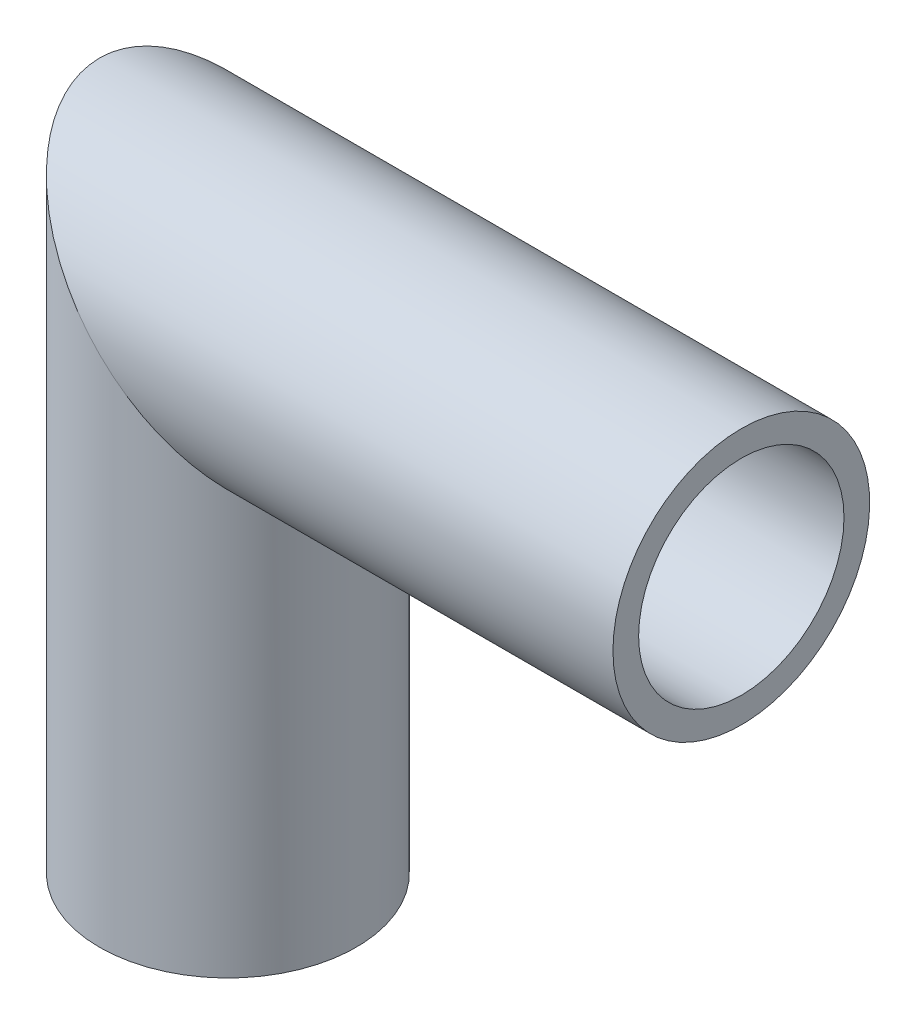
ISO-10303-21;
HEADER;
FILE_DESCRIPTION(('STEP AP214'),'2;1');
FILE_NAME('part.step','',(''),(''),'','','');
FILE_SCHEMA(('AUTOMOTIVE_DESIGN { 1 0 10303 214 1 1 1 1 }'));
ENDSEC;
DATA;
#1=APPLICATION_CONTEXT('core data for automotive mechanical design processes');
#2=APPLICATION_PROTOCOL_DEFINITION('international standard','automotive_design',2000,#1);
#3=PRODUCT_CONTEXT('',#1,'mechanical');
#4=PRODUCT('Part','Part','',(#3));
#5=PRODUCT_RELATED_PRODUCT_CATEGORY('part','',(#4));
#6=PRODUCT_DEFINITION_FORMATION('','',#4);
#7=PRODUCT_DEFINITION_CONTEXT('part definition',#1,'design');
#8=PRODUCT_DEFINITION('design','',#6,#7);
#9=PRODUCT_DEFINITION_SHAPE('','',#8);
#10=(LENGTH_UNIT() NAMED_UNIT(*) SI_UNIT(.MILLI.,.METRE.));
#11=(NAMED_UNIT(*) PLANE_ANGLE_UNIT() SI_UNIT($,.RADIAN.));
#12=(NAMED_UNIT(*) SI_UNIT($,.STERADIAN.) SOLID_ANGLE_UNIT());
#13=UNCERTAINTY_MEASURE_WITH_UNIT(LENGTH_MEASURE(1.E-05),#10,'distance_accuracy_value','');
#14=(GEOMETRIC_REPRESENTATION_CONTEXT(3) GLOBAL_UNCERTAINTY_ASSIGNED_CONTEXT((#13)) GLOBAL_UNIT_ASSIGNED_CONTEXT((#10,
#11,#12)) REPRESENTATION_CONTEXT('',''));
#15=CARTESIAN_POINT('',(0.,0.,0.));
#16=DIRECTION('',(0.,0.,1.));
#17=DIRECTION('',(1.,0.,0.));
#18=AXIS2_PLACEMENT_3D('',#15,#16,#17);
#19=CARTESIAN_POINT('',(-27.6,50.,0.));
#20=DIRECTION('',(1.,0.,0.));
#21=DIRECTION('',(0.,0.,-1.));
#22=AXIS2_PLACEMENT_3D('',#19,#20,#21);
#23=CYLINDRICAL_SURFACE('',#22,12.5);
#24=CARTESIAN_POINT('',(0.,50.,0.));
#25=DIRECTION('',(0.707106781186547,0.707106781186547,0.));
#26=DIRECTION('',(-0.707106781186548,0.707106781186548,0.));
#27=AXIS2_PLACEMENT_3D('',#24,#25,#26);
#28=ELLIPSE('',#27,17.6776695296637,12.5);
#29=CARTESIAN_POINT('',(-12.5,62.5,0.));
#30=VERTEX_POINT('',#29);
#31=EDGE_CURVE('E36',#30,#30,#28,.F.);
#32=ORIENTED_EDGE('',*,*,#31,.F.);
#33=EDGE_LOOP('',(#32));
#34=FACE_BOUND('',#33,.T.);
#35=CARTESIAN_POINT('',(50.,50.,0.));
#36=DIRECTION('',(1.,0.,0.));
#37=DIRECTION('',(0.,0.,1.));
#38=AXIS2_PLACEMENT_3D('',#35,#36,#37);
#39=CIRCLE('',#38,12.5);
#40=CARTESIAN_POINT('',(50.,50.,12.5));
#41=VERTEX_POINT('',#40);
#42=EDGE_CURVE('E47',#41,#41,#39,.T.);
#43=ORIENTED_EDGE('',*,*,#42,.F.);
#44=EDGE_LOOP('',(#43));
#45=FACE_BOUND('',#44,.T.);
#46=ADVANCED_FACE('F33',(#34,#45),#23,.T.);
#47=CARTESIAN_POINT('',(0.,0.,0.));
#48=DIRECTION('',(0.,1.,0.));
#49=DIRECTION('',(0.,0.,1.));
#50=AXIS2_PLACEMENT_3D('',#47,#48,#49);
#51=CYLINDRICAL_SURFACE('',#50,12.5);
#52=CARTESIAN_POINT('',(0.,0.,0.));
#53=DIRECTION('',(0.,1.,0.));
#54=DIRECTION('',(0.,0.,1.));
#55=AXIS2_PLACEMENT_3D('',#52,#53,#54);
#56=CIRCLE('',#55,12.5);
#57=CARTESIAN_POINT('',(0.,0.,12.5));
#58=VERTEX_POINT('',#57);
#59=EDGE_CURVE('E53',#58,#58,#56,.T.);
#60=ORIENTED_EDGE('',*,*,#59,.T.);
#61=EDGE_LOOP('',(#60));
#62=FACE_BOUND('',#61,.T.);
#63=ORIENTED_EDGE('',*,*,#31,.T.);
#64=EDGE_LOOP('',(#63));
#65=FACE_BOUND('',#64,.T.);
#66=ADVANCED_FACE('F78',(#62,#65),#51,.T.);
#67=CARTESIAN_POINT('',(50.,50.,0.));
#68=DIRECTION('',(1.,0.,0.));
#69=DIRECTION('',(0.,0.,1.));
#70=AXIS2_PLACEMENT_3D('',#67,#68,#69);
#71=PLANE('',#70);
#72=CARTESIAN_POINT('',(50.,50.,0.));
#73=DIRECTION('',(1.,0.,0.));
#74=DIRECTION('',(0.,0.,1.));
#75=AXIS2_PLACEMENT_3D('',#72,#73,#74);
#76=CIRCLE('',#75,10.);
#77=CARTESIAN_POINT('',(50.,50.,10.));
#78=VERTEX_POINT('',#77);
#79=EDGE_CURVE('E72',#78,#78,#76,.F.);
#80=ORIENTED_EDGE('',*,*,#79,.T.);
#81=EDGE_LOOP('',(#80));
#82=FACE_BOUND('',#81,.T.);
#83=ORIENTED_EDGE('',*,*,#42,.T.);
#84=EDGE_LOOP('',(#83));
#85=FACE_BOUND('',#84,.T.);
#86=ADVANCED_FACE('F80',(#82,#85),#71,.T.);
#87=CARTESIAN_POINT('',(0.,0.,0.));
#88=DIRECTION('',(0.,1.,0.));
#89=DIRECTION('',(0.,0.,1.));
#90=AXIS2_PLACEMENT_3D('',#87,#88,#89);
#91=PLANE('',#90);
#92=CARTESIAN_POINT('',(0.,0.,0.));
#93=DIRECTION('',(0.,1.,0.));
#94=DIRECTION('',(0.,0.,1.));
#95=AXIS2_PLACEMENT_3D('',#92,#93,#94);
#96=CIRCLE('',#95,10.);
#97=CARTESIAN_POINT('',(0.,0.,10.));
#98=VERTEX_POINT('',#97);
#99=EDGE_CURVE('E41',#98,#98,#96,.F.);
#100=ORIENTED_EDGE('',*,*,#99,.F.);
#101=EDGE_LOOP('',(#100));
#102=FACE_BOUND('',#101,.T.);
#103=ORIENTED_EDGE('',*,*,#59,.F.);
#104=EDGE_LOOP('',(#103));
#105=FACE_BOUND('',#104,.T.);
#106=ADVANCED_FACE('F69',(#102,#105),#91,.F.);
#107=CARTESIAN_POINT('',(-22.1,50.,0.));
#108=DIRECTION('',(1.,0.,0.));
#109=DIRECTION('',(0.,0.,-1.));
#110=AXIS2_PLACEMENT_3D('',#107,#108,#109);
#111=CYLINDRICAL_SURFACE('',#110,10.);
#112=CARTESIAN_POINT('',(0.,50.,0.));
#113=DIRECTION('',(0.707106781186547,0.707106781186547,0.));
#114=DIRECTION('',(-0.707106781186548,0.707106781186548,0.));
#115=AXIS2_PLACEMENT_3D('',#112,#113,#114);
#116=ELLIPSE('',#115,14.142135623731,10.);
#117=CARTESIAN_POINT('',(-10.,60.,0.));
#118=VERTEX_POINT('',#117);
#119=EDGE_CURVE('E11',#118,#118,#116,.T.);
#120=ORIENTED_EDGE('',*,*,#119,.F.);
#121=EDGE_LOOP('',(#120));
#122=FACE_BOUND('',#121,.T.);
#123=ORIENTED_EDGE('',*,*,#79,.F.);
#124=EDGE_LOOP('',(#123));
#125=FACE_BOUND('',#124,.T.);
#126=ADVANCED_FACE('F89',(#122,#125),#111,.F.);
#127=CARTESIAN_POINT('',(0.,0.,0.));
#128=DIRECTION('',(0.,1.,0.));
#129=DIRECTION('',(0.,0.,1.));
#130=AXIS2_PLACEMENT_3D('',#127,#128,#129);
#131=CYLINDRICAL_SURFACE('',#130,10.);
#132=ORIENTED_EDGE('',*,*,#99,.T.);
#133=EDGE_LOOP('',(#132));
#134=FACE_BOUND('',#133,.T.);
#135=ORIENTED_EDGE('',*,*,#119,.T.);
#136=EDGE_LOOP('',(#135));
#137=FACE_BOUND('',#136,.T.);
#138=ADVANCED_FACE('F87',(#134,#137),#131,.F.);
#139=CLOSED_SHELL('',(#46,#66,#86,#106,#126,#138));
#140=MANIFOLD_SOLID_BREP('B2',#139);
#141=ADVANCED_BREP_SHAPE_REPRESENTATION('',(#18,#140),#14);
#142=SHAPE_DEFINITION_REPRESENTATION(#9,#141);
ENDSEC;
END-ISO-10303-21;
